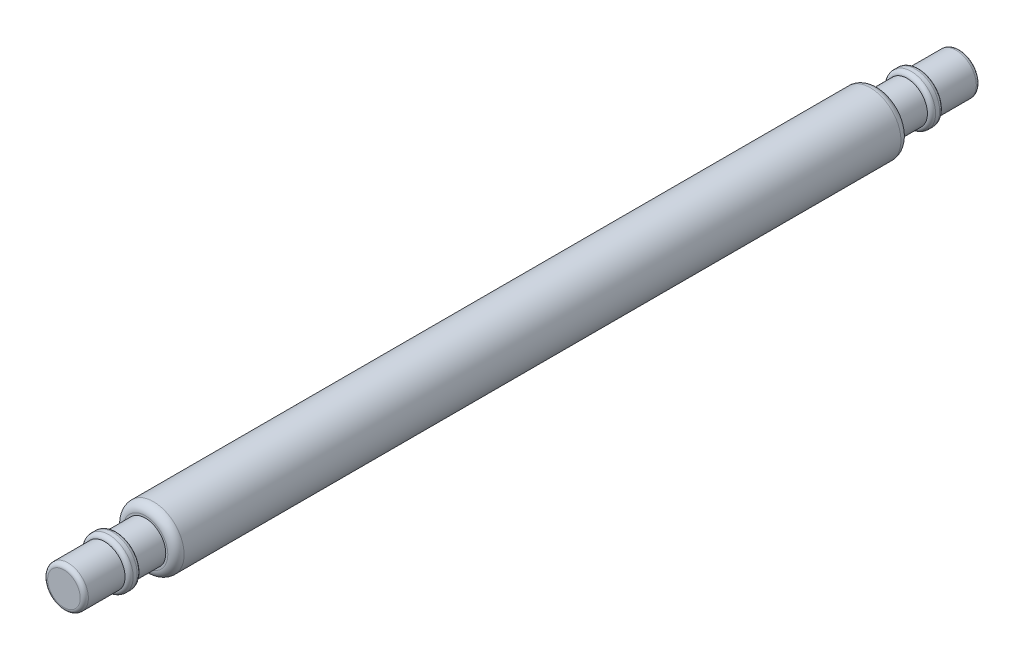
ISO-10303-21;
HEADER;
FILE_DESCRIPTION(('STEP AP214'),'2;1');
FILE_NAME('part.step','',(''),(''),'','','');
FILE_SCHEMA(('AUTOMOTIVE_DESIGN { 1 0 10303 214 1 1 1 1 }'));
ENDSEC;
DATA;
#1=APPLICATION_CONTEXT('core data for automotive mechanical design processes');
#2=APPLICATION_PROTOCOL_DEFINITION('international standard','automotive_design',2000,#1);
#3=PRODUCT_CONTEXT('',#1,'mechanical');
#4=PRODUCT('Part','Part','',(#3));
#5=PRODUCT_RELATED_PRODUCT_CATEGORY('part','',(#4));
#6=PRODUCT_DEFINITION_FORMATION('','',#4);
#7=PRODUCT_DEFINITION_CONTEXT('part definition',#1,'design');
#8=PRODUCT_DEFINITION('design','',#6,#7);
#9=PRODUCT_DEFINITION_SHAPE('','',#8);
#10=(LENGTH_UNIT() NAMED_UNIT(*) SI_UNIT(.MILLI.,.METRE.));
#11=(NAMED_UNIT(*) PLANE_ANGLE_UNIT() SI_UNIT($,.RADIAN.));
#12=(NAMED_UNIT(*) SI_UNIT($,.STERADIAN.) SOLID_ANGLE_UNIT());
#13=UNCERTAINTY_MEASURE_WITH_UNIT(LENGTH_MEASURE(1.E-05),#10,'distance_accuracy_value','');
#14=(GEOMETRIC_REPRESENTATION_CONTEXT(3) GLOBAL_UNCERTAINTY_ASSIGNED_CONTEXT((#13)) GLOBAL_UNIT_ASSIGNED_CONTEXT((#10,
#11,#12)) REPRESENTATION_CONTEXT('',''));
#15=CARTESIAN_POINT('',(0.,0.,0.));
#16=DIRECTION('',(0.,0.,1.));
#17=DIRECTION('',(1.,0.,0.));
#18=AXIS2_PLACEMENT_3D('',#15,#16,#17);
#19=CARTESIAN_POINT('',(0.,0.,9.));
#20=DIRECTION('',(0.,0.,1.));
#21=DIRECTION('',(1.,0.,0.));
#22=AXIS2_PLACEMENT_3D('',#19,#20,#21);
#23=CYLINDRICAL_SURFACE('',#22,0.5);
#24=CARTESIAN_POINT('',(0.,0.,9.));
#25=DIRECTION('',(0.,0.,1.));
#26=DIRECTION('',(1.,0.,0.));
#27=AXIS2_PLACEMENT_3D('',#24,#25,#26);
#28=CIRCLE('',#27,0.5);
#29=CARTESIAN_POINT('',(0.5,0.,9.));
#30=VERTEX_POINT('',#29);
#31=EDGE_CURVE('E87',#30,#30,#28,.T.);
#32=ORIENTED_EDGE('',*,*,#31,.T.);
#33=EDGE_LOOP('',(#32));
#34=FACE_BOUND('',#33,.T.);
#35=CARTESIAN_POINT('',(0.,0.,9.7));
#36=DIRECTION('',(0.,0.,-1.));
#37=DIRECTION('',(-1.,0.,0.));
#38=AXIS2_PLACEMENT_3D('',#35,#36,#37);
#39=CIRCLE('',#38,0.5);
#40=CARTESIAN_POINT('',(-0.5,0.,9.7));
#41=VERTEX_POINT('',#40);
#42=EDGE_CURVE('E97',#41,#41,#39,.T.);
#43=ORIENTED_EDGE('',*,*,#42,.T.);
#44=EDGE_LOOP('',(#43));
#45=FACE_BOUND('',#44,.T.);
#46=ADVANCED_FACE('F35',(#34,#45),#23,.T.);
#47=CARTESIAN_POINT('',(0.,0.,-9.));
#48=DIRECTION('',(0.,0.,-1.));
#49=DIRECTION('',(-1.,0.,0.));
#50=AXIS2_PLACEMENT_3D('',#47,#48,#49);
#51=CYLINDRICAL_SURFACE('',#50,0.5);
#52=CARTESIAN_POINT('',(0.,0.,-9.));
#53=DIRECTION('',(0.,0.,-1.));
#54=DIRECTION('',(-1.,0.,0.));
#55=AXIS2_PLACEMENT_3D('',#52,#53,#54);
#56=CIRCLE('',#55,0.5);
#57=CARTESIAN_POINT('',(-0.5,0.,-9.));
#58=VERTEX_POINT('',#57);
#59=EDGE_CURVE('E91',#58,#58,#56,.T.);
#60=ORIENTED_EDGE('',*,*,#59,.T.);
#61=EDGE_LOOP('',(#60));
#62=FACE_BOUND('',#61,.T.);
#63=CARTESIAN_POINT('',(0.,0.,-9.7));
#64=DIRECTION('',(0.,0.,-1.));
#65=DIRECTION('',(-1.,0.,0.));
#66=AXIS2_PLACEMENT_3D('',#63,#64,#65);
#67=CIRCLE('',#66,0.5);
#68=CARTESIAN_POINT('',(-0.5,0.,-9.7));
#69=VERTEX_POINT('',#68);
#70=EDGE_CURVE('E94',#69,#69,#67,.T.);
#71=ORIENTED_EDGE('',*,*,#70,.F.);
#72=EDGE_LOOP('',(#71));
#73=FACE_BOUND('',#72,.T.);
#74=ADVANCED_FACE('F116',(#62,#73),#51,.T.);
#75=CARTESIAN_POINT('',(0.,0.,11.));
#76=DIRECTION('',(0.,0.,-1.));
#77=DIRECTION('',(-1.,0.,0.));
#78=AXIS2_PLACEMENT_3D('',#75,#76,#77);
#79=CYLINDRICAL_SURFACE('',#78,0.75);
#80=CARTESIAN_POINT('',(0.,0.,8.8));
#81=DIRECTION('',(0.,0.,1.));
#82=DIRECTION('',(1.,0.,0.));
#83=AXIS2_PLACEMENT_3D('',#80,#81,#82);
#84=CIRCLE('',#83,0.75);
#85=CARTESIAN_POINT('',(0.75,0.,8.8));
#86=VERTEX_POINT('',#85);
#87=EDGE_CURVE('E73',#86,#86,#84,.F.);
#88=ORIENTED_EDGE('',*,*,#87,.T.);
#89=EDGE_LOOP('',(#88));
#90=FACE_BOUND('',#89,.T.);
#91=CARTESIAN_POINT('',(0.,0.,-8.8));
#92=DIRECTION('',(0.,0.,-1.));
#93=DIRECTION('',(-1.,0.,0.));
#94=AXIS2_PLACEMENT_3D('',#91,#92,#93);
#95=CIRCLE('',#94,0.75);
#96=CARTESIAN_POINT('',(-0.75,0.,-8.8));
#97=VERTEX_POINT('',#96);
#98=EDGE_CURVE('E77',#97,#97,#95,.F.);
#99=ORIENTED_EDGE('',*,*,#98,.T.);
#100=EDGE_LOOP('',(#99));
#101=FACE_BOUND('',#100,.T.);
#102=ADVANCED_FACE('F122',(#90,#101),#79,.T.);
#103=CARTESIAN_POINT('',(0.,0.,9.));
#104=DIRECTION('',(0.,0.,1.));
#105=DIRECTION('',(1.,0.,0.));
#106=AXIS2_PLACEMENT_3D('',#103,#104,#105);
#107=PLANE('',#106);
#108=CARTESIAN_POINT('',(0.,0.,9.));
#109=DIRECTION('',(0.,0.,1.));
#110=DIRECTION('',(1.,0.,0.));
#111=AXIS2_PLACEMENT_3D('',#108,#109,#110);
#112=CIRCLE('',#111,0.55);
#113=CARTESIAN_POINT('',(0.55,0.,9.));
#114=VERTEX_POINT('',#113);
#115=EDGE_CURVE('E80',#114,#114,#112,.T.);
#116=ORIENTED_EDGE('',*,*,#115,.T.);
#117=EDGE_LOOP('',(#116));
#118=FACE_BOUND('',#117,.T.);
#119=ORIENTED_EDGE('',*,*,#31,.F.);
#120=EDGE_LOOP('',(#119));
#121=FACE_BOUND('',#120,.T.);
#122=ADVANCED_FACE('F161',(#118,#121),#107,.T.);
#123=CARTESIAN_POINT('',(0.,0.,-9.));
#124=DIRECTION('',(0.,0.,-1.));
#125=DIRECTION('',(-1.,0.,0.));
#126=AXIS2_PLACEMENT_3D('',#123,#124,#125);
#127=PLANE('',#126);
#128=CARTESIAN_POINT('',(0.,0.,-9.));
#129=DIRECTION('',(0.,0.,-1.));
#130=DIRECTION('',(-1.,0.,0.));
#131=AXIS2_PLACEMENT_3D('',#128,#129,#130);
#132=CIRCLE('',#131,0.55);
#133=CARTESIAN_POINT('',(-0.55,0.,-9.));
#134=VERTEX_POINT('',#133);
#135=EDGE_CURVE('E70',#134,#134,#132,.T.);
#136=ORIENTED_EDGE('',*,*,#135,.T.);
#137=EDGE_LOOP('',(#136));
#138=FACE_BOUND('',#137,.T.);
#139=ORIENTED_EDGE('',*,*,#59,.F.);
#140=EDGE_LOOP('',(#139));
#141=FACE_BOUND('',#140,.T.);
#142=ADVANCED_FACE('F155',(#138,#141),#127,.T.);
#143=CARTESIAN_POINT('',(0.,0.,-9.7));
#144=DIRECTION('',(0.,0.,-1.));
#145=DIRECTION('',(-1.,0.,0.));
#146=AXIS2_PLACEMENT_3D('',#143,#144,#145);
#147=CYLINDRICAL_SURFACE('',#146,0.6);
#148=CARTESIAN_POINT('',(0.,0.,-9.9));
#149=DIRECTION('',(0.,0.,-1.));
#150=DIRECTION('',(-1.,0.,0.));
#151=AXIS2_PLACEMENT_3D('',#148,#149,#150);
#152=CIRCLE('',#151,0.6);
#153=CARTESIAN_POINT('',(-0.6,0.,-9.9));
#154=VERTEX_POINT('',#153);
#155=EDGE_CURVE('E64',#154,#154,#152,.F.);
#156=ORIENTED_EDGE('',*,*,#155,.T.);
#157=EDGE_LOOP('',(#156));
#158=FACE_BOUND('',#157,.T.);
#159=CARTESIAN_POINT('',(0.,0.,-9.8));
#160=DIRECTION('',(0.,0.,-1.));
#161=DIRECTION('',(-1.,0.,0.));
#162=AXIS2_PLACEMENT_3D('',#159,#160,#161);
#163=CIRCLE('',#162,0.6);
#164=CARTESIAN_POINT('',(-0.6,0.,-9.8));
#165=VERTEX_POINT('',#164);
#166=EDGE_CURVE('E67',#165,#165,#163,.T.);
#167=ORIENTED_EDGE('',*,*,#166,.T.);
#168=EDGE_LOOP('',(#167));
#169=FACE_BOUND('',#168,.T.);
#170=ADVANCED_FACE('F152',(#158,#169),#147,.T.);
#171=CARTESIAN_POINT('',(0.,0.,-11.));
#172=DIRECTION('',(0.,0.,1.));
#173=DIRECTION('',(1.,0.,0.));
#174=AXIS2_PLACEMENT_3D('',#171,#172,#173);
#175=PLANE('',#174);
#176=CARTESIAN_POINT('',(0.,0.,-11.));
#177=DIRECTION('',(0.,0.,1.));
#178=DIRECTION('',(1.,0.,0.));
#179=AXIS2_PLACEMENT_3D('',#176,#177,#178);
#180=CIRCLE('',#179,0.4);
#181=CARTESIAN_POINT('',(0.4,0.,-11.));
#182=VERTEX_POINT('',#181);
#183=EDGE_CURVE('E61',#182,#182,#180,.F.);
#184=ORIENTED_EDGE('',*,*,#183,.T.);
#185=EDGE_LOOP('',(#184));
#186=FACE_BOUND('',#185,.T.);
#187=ADVANCED_FACE('F154',(#186),#175,.F.);
#188=CARTESIAN_POINT('',(0.,0.,-10.9));
#189=DIRECTION('',(0.,0.,1.));
#190=DIRECTION('',(1.,0.,0.));
#191=AXIS2_PLACEMENT_3D('',#188,#189,#190);
#192=CIRCLE('',#191,0.5);
#193=CARTESIAN_POINT('',(0.5,0.,-10.9));
#194=VERTEX_POINT('',#193);
#195=EDGE_CURVE('E58',#194,#194,#192,.T.);
#196=ORIENTED_EDGE('',*,*,#195,.T.);
#197=EDGE_LOOP('',(#196));
#198=FACE_BOUND('',#197,.T.);
#199=CARTESIAN_POINT('',(0.,0.,-10.));
#200=DIRECTION('',(0.,0.,-1.));
#201=DIRECTION('',(-1.,0.,0.));
#202=AXIS2_PLACEMENT_3D('',#199,#200,#201);
#203=CIRCLE('',#202,0.5);
#204=CARTESIAN_POINT('',(-0.5,0.,-10.));
#205=VERTEX_POINT('',#204);
#206=EDGE_CURVE('E84',#205,#205,#203,.F.);
#207=ORIENTED_EDGE('',*,*,#206,.F.);
#208=EDGE_LOOP('',(#207));
#209=FACE_BOUND('',#208,.T.);
#210=ADVANCED_FACE('F125',(#198,#209),#51,.T.);
#211=CARTESIAN_POINT('',(0.,0.,8.8));
#212=DIRECTION('',(0.,0.,1.));
#213=DIRECTION('',(1.,0.,0.));
#214=AXIS2_PLACEMENT_3D('',#211,#212,#213);
#215=TOROIDAL_SURFACE('',#214,0.55,0.2);
#216=ORIENTED_EDGE('',*,*,#87,.F.);
#217=EDGE_LOOP('',(#216));
#218=FACE_BOUND('',#217,.T.);
#219=ORIENTED_EDGE('',*,*,#115,.F.);
#220=EDGE_LOOP('',(#219));
#221=FACE_BOUND('',#220,.T.);
#222=ADVANCED_FACE('F158',(#218,#221),#215,.T.);
#223=CARTESIAN_POINT('',(0.,0.,-8.8));
#224=DIRECTION('',(0.,0.,-1.));
#225=DIRECTION('',(-1.,0.,0.));
#226=AXIS2_PLACEMENT_3D('',#223,#224,#225);
#227=TOROIDAL_SURFACE('',#226,0.55,0.2);
#228=ORIENTED_EDGE('',*,*,#98,.F.);
#229=EDGE_LOOP('',(#228));
#230=FACE_BOUND('',#229,.T.);
#231=ORIENTED_EDGE('',*,*,#135,.F.);
#232=EDGE_LOOP('',(#231));
#233=FACE_BOUND('',#232,.T.);
#234=ADVANCED_FACE('F183',(#230,#233),#227,.T.);
#235=CARTESIAN_POINT('',(0.,0.,-9.9));
#236=DIRECTION('',(0.,0.,-1.));
#237=DIRECTION('',(-1.,0.,0.));
#238=AXIS2_PLACEMENT_3D('',#235,#236,#237);
#239=TOROIDAL_SURFACE('',#238,0.5,0.1);
#240=ORIENTED_EDGE('',*,*,#155,.F.);
#241=EDGE_LOOP('',(#240));
#242=FACE_BOUND('',#241,.T.);
#243=ORIENTED_EDGE('',*,*,#206,.T.);
#244=EDGE_LOOP('',(#243));
#245=FACE_BOUND('',#244,.T.);
#246=ADVANCED_FACE('F176',(#242,#245),#239,.T.);
#247=CARTESIAN_POINT('',(0.,0.,-9.8));
#248=DIRECTION('',(0.,0.,-1.));
#249=DIRECTION('',(-1.,0.,0.));
#250=AXIS2_PLACEMENT_3D('',#247,#248,#249);
#251=TOROIDAL_SURFACE('',#250,0.5,0.1);
#252=ORIENTED_EDGE('',*,*,#70,.T.);
#253=EDGE_LOOP('',(#252));
#254=FACE_BOUND('',#253,.T.);
#255=ORIENTED_EDGE('',*,*,#166,.F.);
#256=EDGE_LOOP('',(#255));
#257=FACE_BOUND('',#256,.T.);
#258=ADVANCED_FACE('F148',(#254,#257),#251,.T.);
#259=CARTESIAN_POINT('',(0.,0.,-10.9));
#260=DIRECTION('',(0.,0.,1.));
#261=DIRECTION('',(1.,0.,0.));
#262=AXIS2_PLACEMENT_3D('',#259,#260,#261);
#263=TOROIDAL_SURFACE('',#262,0.4,0.1);
#264=ORIENTED_EDGE('',*,*,#195,.F.);
#265=EDGE_LOOP('',(#264));
#266=FACE_BOUND('',#265,.T.);
#267=ORIENTED_EDGE('',*,*,#183,.F.);
#268=EDGE_LOOP('',(#267));
#269=FACE_BOUND('',#268,.T.);
#270=ADVANCED_FACE('F143',(#266,#269),#263,.T.);
#271=CARTESIAN_POINT('',(0.,0.,9.7));
#272=DIRECTION('',(0.,0.,1.));
#273=DIRECTION('',(1.,0.,0.));
#274=AXIS2_PLACEMENT_3D('',#271,#272,#273);
#275=CYLINDRICAL_SURFACE('',#274,0.6);
#276=CARTESIAN_POINT('',(0.,0.,9.9));
#277=DIRECTION('',(0.,0.,1.));
#278=DIRECTION('',(1.,0.,0.));
#279=AXIS2_PLACEMENT_3D('',#276,#277,#278);
#280=CIRCLE('',#279,0.6);
#281=CARTESIAN_POINT('',(0.6,0.,9.9));
#282=VERTEX_POINT('',#281);
#283=EDGE_CURVE('E46',#282,#282,#280,.F.);
#284=ORIENTED_EDGE('',*,*,#283,.T.);
#285=EDGE_LOOP('',(#284));
#286=FACE_BOUND('',#285,.T.);
#287=CARTESIAN_POINT('',(0.,0.,9.8));
#288=DIRECTION('',(0.,0.,1.));
#289=DIRECTION('',(1.,0.,0.));
#290=AXIS2_PLACEMENT_3D('',#287,#288,#289);
#291=CIRCLE('',#290,0.6);
#292=CARTESIAN_POINT('',(0.6,0.,9.8));
#293=VERTEX_POINT('',#292);
#294=EDGE_CURVE('E50',#293,#293,#291,.T.);
#295=ORIENTED_EDGE('',*,*,#294,.T.);
#296=EDGE_LOOP('',(#295));
#297=FACE_BOUND('',#296,.T.);
#298=ADVANCED_FACE('F134',(#286,#297),#275,.T.);
#299=CARTESIAN_POINT('',(0.,0.,11.));
#300=DIRECTION('',(0.,0.,1.));
#301=DIRECTION('',(1.,0.,0.));
#302=AXIS2_PLACEMENT_3D('',#299,#300,#301);
#303=PLANE('',#302);
#304=CARTESIAN_POINT('',(0.,0.,11.));
#305=DIRECTION('',(0.,0.,1.));
#306=DIRECTION('',(1.,0.,0.));
#307=AXIS2_PLACEMENT_3D('',#304,#305,#306);
#308=CIRCLE('',#307,0.4);
#309=CARTESIAN_POINT('',(0.4,0.,11.));
#310=VERTEX_POINT('',#309);
#311=EDGE_CURVE('E42',#310,#310,#308,.T.);
#312=ORIENTED_EDGE('',*,*,#311,.T.);
#313=EDGE_LOOP('',(#312));
#314=FACE_BOUND('',#313,.T.);
#315=ADVANCED_FACE('F129',(#314),#303,.T.);
#316=CARTESIAN_POINT('',(0.,0.,10.9));
#317=DIRECTION('',(0.,0.,1.));
#318=DIRECTION('',(1.,0.,0.));
#319=AXIS2_PLACEMENT_3D('',#316,#317,#318);
#320=CIRCLE('',#319,0.5);
#321=CARTESIAN_POINT('',(0.5,0.,10.9));
#322=VERTEX_POINT('',#321);
#323=EDGE_CURVE('E10',#322,#322,#320,.F.);
#324=ORIENTED_EDGE('',*,*,#323,.T.);
#325=EDGE_LOOP('',(#324));
#326=FACE_BOUND('',#325,.T.);
#327=CARTESIAN_POINT('',(0.,0.,10.));
#328=DIRECTION('',(0.,0.,1.));
#329=DIRECTION('',(1.,0.,0.));
#330=AXIS2_PLACEMENT_3D('',#327,#328,#329);
#331=CIRCLE('',#330,0.5);
#332=CARTESIAN_POINT('',(0.5,0.,10.));
#333=VERTEX_POINT('',#332);
#334=EDGE_CURVE('E55',#333,#333,#331,.F.);
#335=ORIENTED_EDGE('',*,*,#334,.F.);
#336=EDGE_LOOP('',(#335));
#337=FACE_BOUND('',#336,.T.);
#338=ADVANCED_FACE('F111',(#326,#337),#23,.T.);
#339=CARTESIAN_POINT('',(0.,0.,9.9));
#340=DIRECTION('',(0.,0.,1.));
#341=DIRECTION('',(1.,0.,0.));
#342=AXIS2_PLACEMENT_3D('',#339,#340,#341);
#343=TOROIDAL_SURFACE('',#342,0.5,0.1);
#344=ORIENTED_EDGE('',*,*,#334,.T.);
#345=EDGE_LOOP('',(#344));
#346=FACE_BOUND('',#345,.T.);
#347=ORIENTED_EDGE('',*,*,#283,.F.);
#348=EDGE_LOOP('',(#347));
#349=FACE_BOUND('',#348,.T.);
#350=ADVANCED_FACE('F104',(#346,#349),#343,.T.);
#351=CARTESIAN_POINT('',(0.,0.,9.8));
#352=DIRECTION('',(0.,0.,1.));
#353=DIRECTION('',(1.,0.,0.));
#354=AXIS2_PLACEMENT_3D('',#351,#352,#353);
#355=TOROIDAL_SURFACE('',#354,0.5,0.1);
#356=ORIENTED_EDGE('',*,*,#294,.F.);
#357=EDGE_LOOP('',(#356));
#358=FACE_BOUND('',#357,.T.);
#359=ORIENTED_EDGE('',*,*,#42,.F.);
#360=EDGE_LOOP('',(#359));
#361=FACE_BOUND('',#360,.T.);
#362=ADVANCED_FACE('F102',(#358,#361),#355,.T.);
#363=CARTESIAN_POINT('',(0.,0.,10.9));
#364=DIRECTION('',(0.,0.,1.));
#365=DIRECTION('',(1.,0.,0.));
#366=AXIS2_PLACEMENT_3D('',#363,#364,#365);
#367=TOROIDAL_SURFACE('',#366,0.4,0.1);
#368=ORIENTED_EDGE('',*,*,#323,.F.);
#369=EDGE_LOOP('',(#368));
#370=FACE_BOUND('',#369,.T.);
#371=ORIENTED_EDGE('',*,*,#311,.F.);
#372=EDGE_LOOP('',(#371));
#373=FACE_BOUND('',#372,.T.);
#374=ADVANCED_FACE('F37',(#370,#373),#367,.T.);
#375=CLOSED_SHELL('',(#46,#74,#102,#122,#142,#170,#187,#210,#222,#234,#246,#258,#270,#298,#315,
#338,#350,#362,#374));
#376=MANIFOLD_SOLID_BREP('B2',#375);
#377=ADVANCED_BREP_SHAPE_REPRESENTATION('',(#18,#376),#14);
#378=SHAPE_DEFINITION_REPRESENTATION(#9,#377);
ENDSEC;
END-ISO-10303-21;
